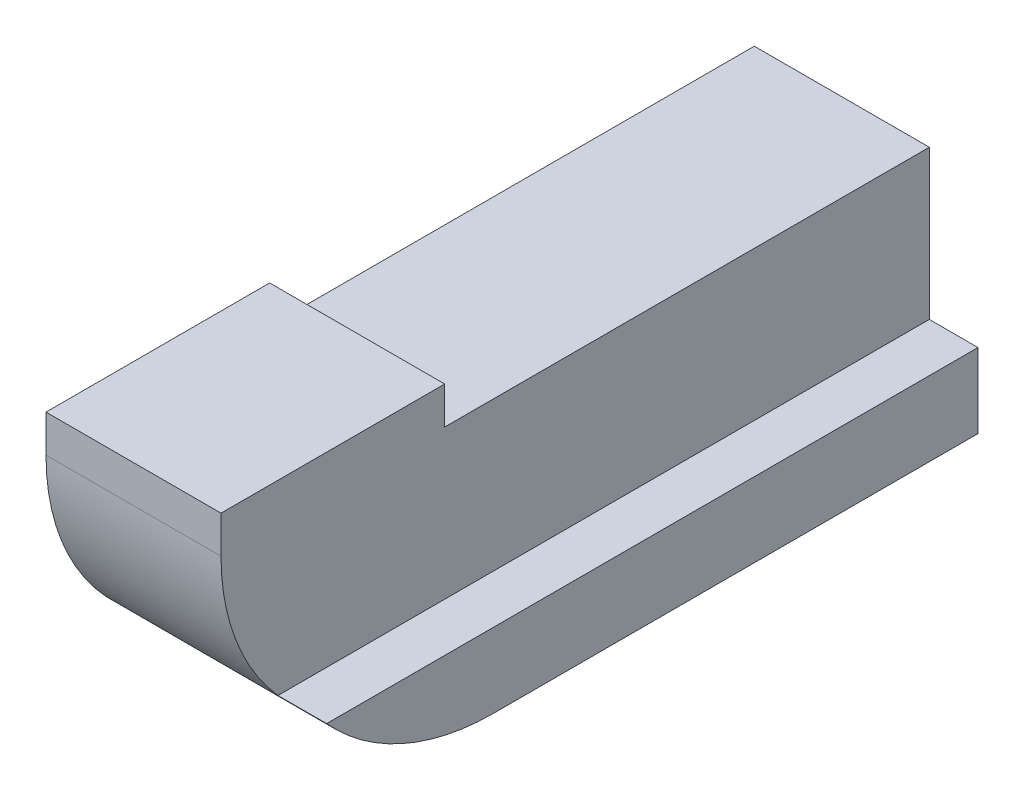
ISO-10303-21;
HEADER;
FILE_DESCRIPTION(('STEP AP214'),'2;1');
FILE_NAME('part.step','',(''),(''),'','','');
FILE_SCHEMA(('AUTOMOTIVE_DESIGN { 1 0 10303 214 1 1 1 1 }'));
ENDSEC;
DATA;
#1=APPLICATION_CONTEXT('core data for automotive mechanical design processes');
#2=APPLICATION_PROTOCOL_DEFINITION('international standard','automotive_design',2000,#1);
#3=PRODUCT_CONTEXT('',#1,'mechanical');
#4=PRODUCT('Part','Part','',(#3));
#5=PRODUCT_RELATED_PRODUCT_CATEGORY('part','',(#4));
#6=PRODUCT_DEFINITION_FORMATION('','',#4);
#7=PRODUCT_DEFINITION_CONTEXT('part definition',#1,'design');
#8=PRODUCT_DEFINITION('design','',#6,#7);
#9=PRODUCT_DEFINITION_SHAPE('','',#8);
#10=(LENGTH_UNIT() NAMED_UNIT(*) SI_UNIT(.MILLI.,.METRE.));
#11=(NAMED_UNIT(*) PLANE_ANGLE_UNIT() SI_UNIT($,.RADIAN.));
#12=(NAMED_UNIT(*) SI_UNIT($,.STERADIAN.) SOLID_ANGLE_UNIT());
#13=UNCERTAINTY_MEASURE_WITH_UNIT(LENGTH_MEASURE(1.E-05),#10,'distance_accuracy_value','');
#14=(GEOMETRIC_REPRESENTATION_CONTEXT(3) GLOBAL_UNCERTAINTY_ASSIGNED_CONTEXT((#13)) GLOBAL_UNIT_ASSIGNED_CONTEXT((#10,
#11,#12)) REPRESENTATION_CONTEXT('',''));
#15=CARTESIAN_POINT('',(0.,0.,0.));
#16=DIRECTION('',(0.,0.,1.));
#17=DIRECTION('',(1.,0.,0.));
#18=AXIS2_PLACEMENT_3D('',#15,#16,#17);
#19=CARTESIAN_POINT('',(0.169449701348672,1.49999999999999,5.50851754418823));
#20=DIRECTION('',(-1.,0.,0.));
#21=DIRECTION('',(0.,0.,1.));
#22=AXIS2_PLACEMENT_3D('',#19,#20,#21);
#23=PLANE('',#22);
#24=DIRECTION('',(0.,0.,-1.));
#25=VECTOR('',#24,1.);
#26=CARTESIAN_POINT('',(0.169449701348663,-1.19209294258821E-07,0.909947202731074));
#27=LINE('',#26,#25);
#28=CARTESIAN_POINT('',(0.169449701348663,-1.19209294236361E-07,0.697213488875895));
#29=VERTEX_POINT('',#28);
#30=CARTESIAN_POINT('',(0.169449701348664,-1.19209294292266E-07,-1.05));
#31=VERTEX_POINT('',#30);
#32=EDGE_CURVE('E86',#29,#31,#27,.T.);
#33=ORIENTED_EDGE('',*,*,#32,.T.);
#34=DIRECTION('',(0.,1.,0.));
#35=VECTOR('',#34,1.);
#36=CARTESIAN_POINT('',(0.169449701348665,1.49999999999999,-1.05));
#37=LINE('',#36,#35);
#38=CARTESIAN_POINT('',(0.169449701348663,0.4,-1.05));
#39=VERTEX_POINT('',#38);
#40=EDGE_CURVE('E92',#39,#31,#37,.F.);
#41=ORIENTED_EDGE('',*,*,#40,.F.);
#42=DIRECTION('',(0.,0.,1.));
#43=VECTOR('',#42,1.);
#44=CARTESIAN_POINT('',(0.169449701348672,0.4,5.50851754418823));
#45=LINE('',#44,#43);
#46=CARTESIAN_POINT('',(0.169449701348666,0.4,0.250000000000001));
#47=VERTEX_POINT('',#46);
#48=EDGE_CURVE('E124',#47,#39,#45,.F.);
#49=ORIENTED_EDGE('',*,*,#48,.F.);
#50=DIRECTION('',(0.,1.,0.));
#51=VECTOR('',#50,1.);
#52=CARTESIAN_POINT('',(0.169449701348666,1.49999999999999,0.250000000000001));
#53=LINE('',#52,#51);
#54=CARTESIAN_POINT('',(0.169449701348666,0.500000000000001,0.250000000000001));
#55=VERTEX_POINT('',#54);
#56=EDGE_CURVE('E129',#55,#47,#53,.F.);
#57=ORIENTED_EDGE('',*,*,#56,.F.);
#58=DIRECTION('',(0.,0.,1.));
#59=VECTOR('',#58,1.);
#60=CARTESIAN_POINT('',(0.169449701348672,0.500000000000001,5.50851754418823));
#61=LINE('',#60,#59);
#62=CARTESIAN_POINT('',(0.169449701348667,0.500000000000001,0.850000000000001));
#63=VERTEX_POINT('',#62);
#64=EDGE_CURVE('E120',#63,#55,#61,.F.);
#65=ORIENTED_EDGE('',*,*,#64,.F.);
#66=DIRECTION('',(0.,1.,0.));
#67=VECTOR('',#66,1.);
#68=CARTESIAN_POINT('',(0.169449701348667,1.49999999999999,0.850000000000001));
#69=LINE('',#68,#67);
#70=CARTESIAN_POINT('',(0.169449701348665,0.400000000000001,0.850000000000001));
#71=VERTEX_POINT('',#70);
#72=EDGE_CURVE('E88',#71,#63,#69,.T.);
#73=ORIENTED_EDGE('',*,*,#72,.F.);
#74=CARTESIAN_POINT('',(0.169449701348663,0.400000000000001,0.250000000000001));
#75=DIRECTION('',(1.,0.,0.));
#76=DIRECTION('',(0.,0.,-1.));
#77=AXIS2_PLACEMENT_3D('',#74,#75,#76);
#78=CIRCLE('',#77,0.6);
#79=EDGE_CURVE('E20',#29,#71,#78,.F.);
#80=ORIENTED_EDGE('',*,*,#79,.F.);
#81=EDGE_LOOP('',(#33,#41,#49,#57,#65,#73,#80));
#82=FACE_BOUND('',#81,.T.);
#83=ADVANCED_FACE('F17',(#82),#23,.F.);
#84=CARTESIAN_POINT('',(2.03266376100017,-1.19209294258821E-07,0.909947202731074));
#85=DIRECTION('',(0.,-1.,0.));
#86=DIRECTION('',(0.,0.,-1.));
#87=AXIS2_PLACEMENT_3D('',#84,#85,#86);
#88=PLANE('',#87);
#89=DIRECTION('',(0.,0.,1.));
#90=VECTOR('',#89,1.);
#91=CARTESIAN_POINT('',(0.299999999999999,-1.19209294237137E-07,0.250000000000001));
#92=LINE('',#91,#90);
#93=CARTESIAN_POINT('',(0.299999999999999,-1.19209294242742E-07,0.697213488875895));
#94=VERTEX_POINT('',#93);
#95=CARTESIAN_POINT('',(0.299999999999999,-1.19209294246631E-07,-1.05));
#96=VERTEX_POINT('',#95);
#97=EDGE_CURVE('E109',#94,#96,#92,.F.);
#98=ORIENTED_EDGE('',*,*,#97,.T.);
#99=DIRECTION('',(1.,0.,0.));
#100=VECTOR('',#99,1.);
#101=CARTESIAN_POINT('',(2.03266376100017,-1.19209294265621E-07,-1.05));
#102=LINE('',#101,#100);
#103=EDGE_CURVE('E100',#31,#96,#102,.T.);
#104=ORIENTED_EDGE('',*,*,#103,.F.);
#105=ORIENTED_EDGE('',*,*,#32,.F.);
#106=DIRECTION('',(1.,0.,0.));
#107=VECTOR('',#106,1.);
#108=CARTESIAN_POINT('',(2.03266376100017,-1.19209294259559E-07,0.697213488875895));
#109=LINE('',#108,#107);
#110=EDGE_CURVE('E97',#94,#29,#109,.F.);
#111=ORIENTED_EDGE('',*,*,#110,.F.);
#112=EDGE_LOOP('',(#98,#104,#105,#111));
#113=FACE_BOUND('',#112,.T.);
#114=ADVANCED_FACE('F96',(#113),#88,.F.);
#115=CARTESIAN_POINT('',(0.299999999999999,-0.199999999999999,0.250000000000001));
#116=DIRECTION('',(-1.,0.,0.));
#117=DIRECTION('',(0.,-1.,0.));
#118=AXIS2_PLACEMENT_3D('',#115,#116,#117);
#119=PLANE('',#118);
#120=CARTESIAN_POINT('',(0.299999999999999,0.400000000000001,0.250000000000001));
#121=DIRECTION('',(1.,0.,0.));
#122=DIRECTION('',(0.,0.,-1.));
#123=AXIS2_PLACEMENT_3D('',#120,#121,#122);
#124=CIRCLE('',#123,0.6);
#125=CARTESIAN_POINT('',(0.299999999999999,-0.199999999999999,0.250000000000001));
#126=VERTEX_POINT('',#125);
#127=EDGE_CURVE('E106',#126,#94,#124,.F.);
#128=ORIENTED_EDGE('',*,*,#127,.F.);
#129=DIRECTION('',(0.,0.,1.));
#130=VECTOR('',#129,1.);
#131=CARTESIAN_POINT('',(0.299999999999999,-0.199999999999999,0.));
#132=LINE('',#131,#130);
#133=CARTESIAN_POINT('',(0.299999999999999,-0.199999999999999,-1.05));
#134=VERTEX_POINT('',#133);
#135=EDGE_CURVE('E143',#134,#126,#132,.T.);
#136=ORIENTED_EDGE('',*,*,#135,.F.);
#137=DIRECTION('',(0.,-1.,0.));
#138=VECTOR('',#137,1.);
#139=CARTESIAN_POINT('',(0.299999999999999,-0.199999999999999,-1.05));
#140=LINE('',#139,#138);
#141=EDGE_CURVE('E107',#96,#134,#140,.T.);
#142=ORIENTED_EDGE('',*,*,#141,.F.);
#143=ORIENTED_EDGE('',*,*,#97,.F.);
#144=EDGE_LOOP('',(#128,#136,#142,#143));
#145=FACE_BOUND('',#144,.T.);
#146=ADVANCED_FACE('F193',(#145),#119,.F.);
#147=CARTESIAN_POINT('',(0.299999999999999,0.4,-5.55));
#148=DIRECTION('',(0.,-1.,0.));
#149=DIRECTION('',(0.,0.,-1.));
#150=AXIS2_PLACEMENT_3D('',#147,#148,#149);
#151=PLANE('',#150);
#152=DIRECTION('',(1.,0.,0.));
#153=VECTOR('',#152,1.);
#154=CARTESIAN_POINT('',(1.5,0.4,-1.05));
#155=LINE('',#154,#153);
#156=CARTESIAN_POINT('',(-0.300000000000001,0.4,-1.05));
#157=VERTEX_POINT('',#156);
#158=EDGE_CURVE('E183',#39,#157,#155,.F.);
#159=ORIENTED_EDGE('',*,*,#158,.T.);
#160=DIRECTION('',(0.,0.,1.));
#161=VECTOR('',#160,1.);
#162=CARTESIAN_POINT('',(-0.300000000000001,0.4,0.850000000000001));
#163=LINE('',#162,#161);
#164=CARTESIAN_POINT('',(-0.300000000000001,0.4,0.250000000000001));
#165=VERTEX_POINT('',#164);
#166=EDGE_CURVE('E172',#157,#165,#163,.T.);
#167=ORIENTED_EDGE('',*,*,#166,.T.);
#168=DIRECTION('',(1.,0.,0.));
#169=VECTOR('',#168,1.);
#170=CARTESIAN_POINT('',(-0.300000000000001,0.4,0.250000000000001));
#171=LINE('',#170,#169);
#172=EDGE_CURVE('E167',#165,#47,#171,.T.);
#173=ORIENTED_EDGE('',*,*,#172,.T.);
#174=ORIENTED_EDGE('',*,*,#48,.T.);
#175=EDGE_LOOP('',(#159,#167,#173,#174));
#176=FACE_BOUND('',#175,.T.);
#177=ADVANCED_FACE('F198',(#176),#151,.F.);
#178=CARTESIAN_POINT('',(-0.300000000000001,-0.199999999999999,0.250000000000001));
#179=DIRECTION('',(0.,0.,1.));
#180=DIRECTION('',(1.,0.,0.));
#181=AXIS2_PLACEMENT_3D('',#178,#179,#180);
#182=PLANE('',#181);
#183=ORIENTED_EDGE('',*,*,#172,.F.);
#184=DIRECTION('',(0.,1.,0.));
#185=VECTOR('',#184,1.);
#186=CARTESIAN_POINT('',(-0.300000000000001,-0.199999999999999,0.250000000000001));
#187=LINE('',#186,#185);
#188=CARTESIAN_POINT('',(-0.300000000000001,0.500000000000001,0.250000000000001));
#189=VERTEX_POINT('',#188);
#190=EDGE_CURVE('E162',#165,#189,#187,.T.);
#191=ORIENTED_EDGE('',*,*,#190,.T.);
#192=DIRECTION('',(1.,0.,0.));
#193=VECTOR('',#192,1.);
#194=CARTESIAN_POINT('',(0.,0.500000000000001,0.250000000000001));
#195=LINE('',#194,#193);
#196=EDGE_CURVE('E151',#189,#55,#195,.T.);
#197=ORIENTED_EDGE('',*,*,#196,.T.);
#198=ORIENTED_EDGE('',*,*,#56,.T.);
#199=EDGE_LOOP('',(#183,#191,#197,#198));
#200=FACE_BOUND('',#199,.T.);
#201=ADVANCED_FACE('F201',(#200),#182,.F.);
#202=CARTESIAN_POINT('',(0.,0.500000000000001,0.));
#203=DIRECTION('',(0.,-1.,0.));
#204=DIRECTION('',(1.,0.,0.));
#205=AXIS2_PLACEMENT_3D('',#202,#203,#204);
#206=PLANE('',#205);
#207=ORIENTED_EDGE('',*,*,#196,.F.);
#208=DIRECTION('',(0.,0.,1.));
#209=VECTOR('',#208,1.);
#210=CARTESIAN_POINT('',(-0.300000000000001,0.500000000000001,0.850000000000001));
#211=LINE('',#210,#209);
#212=CARTESIAN_POINT('',(-0.300000000000001,0.500000000000001,0.850000000000001));
#213=VERTEX_POINT('',#212);
#214=EDGE_CURVE('E159',#189,#213,#211,.T.);
#215=ORIENTED_EDGE('',*,*,#214,.T.);
#216=DIRECTION('',(-1.,0.,0.));
#217=VECTOR('',#216,1.);
#218=CARTESIAN_POINT('',(0.299999999999999,0.500000000000001,0.850000000000001));
#219=LINE('',#218,#217);
#220=EDGE_CURVE('E147',#213,#63,#219,.F.);
#221=ORIENTED_EDGE('',*,*,#220,.T.);
#222=ORIENTED_EDGE('',*,*,#64,.T.);
#223=EDGE_LOOP('',(#207,#215,#221,#222));
#224=FACE_BOUND('',#223,.T.);
#225=ADVANCED_FACE('F204',(#224),#206,.F.);
#226=CARTESIAN_POINT('',(0.299999999999999,-0.199999999999999,0.850000000000001));
#227=DIRECTION('',(0.,0.,-1.));
#228=DIRECTION('',(-1.,0.,0.));
#229=AXIS2_PLACEMENT_3D('',#226,#227,#228);
#230=PLANE('',#229);
#231=ORIENTED_EDGE('',*,*,#220,.F.);
#232=DIRECTION('',(0.,1.,0.));
#233=VECTOR('',#232,1.);
#234=CARTESIAN_POINT('',(-0.300000000000001,-0.199999999999999,0.850000000000001));
#235=LINE('',#234,#233);
#236=CARTESIAN_POINT('',(-0.300000000000001,0.400000000000001,0.850000000000001));
#237=VERTEX_POINT('',#236);
#238=EDGE_CURVE('E142',#213,#237,#235,.F.);
#239=ORIENTED_EDGE('',*,*,#238,.T.);
#240=DIRECTION('',(1.,0.,0.));
#241=VECTOR('',#240,1.);
#242=CARTESIAN_POINT('',(0.,0.400000000000001,0.850000000000001));
#243=LINE('',#242,#241);
#244=EDGE_CURVE('E144',#71,#237,#243,.F.);
#245=ORIENTED_EDGE('',*,*,#244,.F.);
#246=ORIENTED_EDGE('',*,*,#72,.T.);
#247=EDGE_LOOP('',(#231,#239,#245,#246));
#248=FACE_BOUND('',#247,.T.);
#249=ADVANCED_FACE('F208',(#248),#230,.F.);
#250=CARTESIAN_POINT('',(0.,0.400000000000001,0.250000000000001));
#251=DIRECTION('',(1.,0.,0.));
#252=DIRECTION('',(0.,0.,-1.));
#253=AXIS2_PLACEMENT_3D('',#250,#251,#252);
#254=CYLINDRICAL_SURFACE('',#253,0.6);
#255=ORIENTED_EDGE('',*,*,#127,.T.);
#256=ORIENTED_EDGE('',*,*,#110,.T.);
#257=ORIENTED_EDGE('',*,*,#79,.T.);
#258=ORIENTED_EDGE('',*,*,#244,.T.);
#259=CARTESIAN_POINT('',(-0.300000000000001,0.400000000000001,0.250000000000001));
#260=DIRECTION('',(1.,0.,0.));
#261=DIRECTION('',(0.,0.,-1.));
#262=AXIS2_PLACEMENT_3D('',#259,#260,#261);
#263=CIRCLE('',#262,0.6);
#264=CARTESIAN_POINT('',(-0.300000000000001,-0.199999999999999,0.250000000000001));
#265=VERTEX_POINT('',#264);
#266=EDGE_CURVE('E140',#237,#265,#263,.T.);
#267=ORIENTED_EDGE('',*,*,#266,.T.);
#268=DIRECTION('',(1.,0.,0.));
#269=VECTOR('',#268,1.);
#270=CARTESIAN_POINT('',(0.,-0.199999999999999,0.250000000000001));
#271=LINE('',#270,#269);
#272=EDGE_CURVE('E145',#126,#265,#271,.F.);
#273=ORIENTED_EDGE('',*,*,#272,.F.);
#274=EDGE_LOOP('',(#255,#256,#257,#258,#267,#273));
#275=FACE_BOUND('',#274,.T.);
#276=ADVANCED_FACE('F103',(#275),#254,.T.);
#277=CARTESIAN_POINT('',(0.,-0.199999999999999,0.));
#278=DIRECTION('',(0.,-1.,0.));
#279=DIRECTION('',(1.,0.,0.));
#280=AXIS2_PLACEMENT_3D('',#277,#278,#279);
#281=PLANE('',#280);
#282=ORIENTED_EDGE('',*,*,#272,.T.);
#283=DIRECTION('',(0.,0.,1.));
#284=VECTOR('',#283,1.);
#285=CARTESIAN_POINT('',(-0.300000000000001,-0.199999999999999,0.850000000000001));
#286=LINE('',#285,#284);
#287=CARTESIAN_POINT('',(-0.300000000000001,-0.199999999999999,-1.05));
#288=VERTEX_POINT('',#287);
#289=EDGE_CURVE('E26',#265,#288,#286,.F.);
#290=ORIENTED_EDGE('',*,*,#289,.T.);
#291=DIRECTION('',(1.,0.,0.));
#292=VECTOR('',#291,1.);
#293=CARTESIAN_POINT('',(1.5,-0.199999999999999,-1.05));
#294=LINE('',#293,#292);
#295=EDGE_CURVE('E34',#288,#134,#294,.T.);
#296=ORIENTED_EDGE('',*,*,#295,.T.);
#297=ORIENTED_EDGE('',*,*,#135,.T.);
#298=EDGE_LOOP('',(#282,#290,#296,#297));
#299=FACE_BOUND('',#298,.T.);
#300=ADVANCED_FACE('F221',(#299),#281,.T.);
#301=CARTESIAN_POINT('',(1.5,0.25,-1.05));
#302=DIRECTION('',(0.,0.,1.));
#303=DIRECTION('',(1.,0.,0.));
#304=AXIS2_PLACEMENT_3D('',#301,#302,#303);
#305=PLANE('',#304);
#306=ORIENTED_EDGE('',*,*,#103,.T.);
#307=ORIENTED_EDGE('',*,*,#141,.T.);
#308=ORIENTED_EDGE('',*,*,#295,.F.);
#309=DIRECTION('',(0.,1.,0.));
#310=VECTOR('',#309,1.);
#311=CARTESIAN_POINT('',(-0.300000000000001,-0.199999999999999,-1.05));
#312=LINE('',#311,#310);
#313=EDGE_CURVE('E11',#288,#157,#312,.T.);
#314=ORIENTED_EDGE('',*,*,#313,.T.);
#315=ORIENTED_EDGE('',*,*,#158,.F.);
#316=ORIENTED_EDGE('',*,*,#40,.T.);
#317=EDGE_LOOP('',(#306,#307,#308,#314,#315,#316));
#318=FACE_BOUND('',#317,.T.);
#319=ADVANCED_FACE('F195',(#318),#305,.F.);
#320=CARTESIAN_POINT('',(-0.300000000000001,-0.199999999999999,0.850000000000001));
#321=DIRECTION('',(1.,0.,0.));
#322=DIRECTION('',(0.,1.,0.));
#323=AXIS2_PLACEMENT_3D('',#320,#321,#322);
#324=PLANE('',#323);
#325=ORIENTED_EDGE('',*,*,#289,.F.);
#326=ORIENTED_EDGE('',*,*,#266,.F.);
#327=ORIENTED_EDGE('',*,*,#238,.F.);
#328=ORIENTED_EDGE('',*,*,#214,.F.);
#329=ORIENTED_EDGE('',*,*,#190,.F.);
#330=ORIENTED_EDGE('',*,*,#166,.F.);
#331=ORIENTED_EDGE('',*,*,#313,.F.);
#332=EDGE_LOOP('',(#325,#326,#327,#328,#329,#330,#331));
#333=FACE_BOUND('',#332,.T.);
#334=ADVANCED_FACE('F223',(#333),#324,.F.);
#335=CLOSED_SHELL('',(#83,#114,#146,#177,#201,#225,#249,#276,#300,#319,#334));
#336=MANIFOLD_SOLID_BREP('B1',#335);
#337=ADVANCED_BREP_SHAPE_REPRESENTATION('',(#18,#336),#14);
#338=SHAPE_DEFINITION_REPRESENTATION(#9,#337);
ENDSEC;
END-ISO-10303-21;
